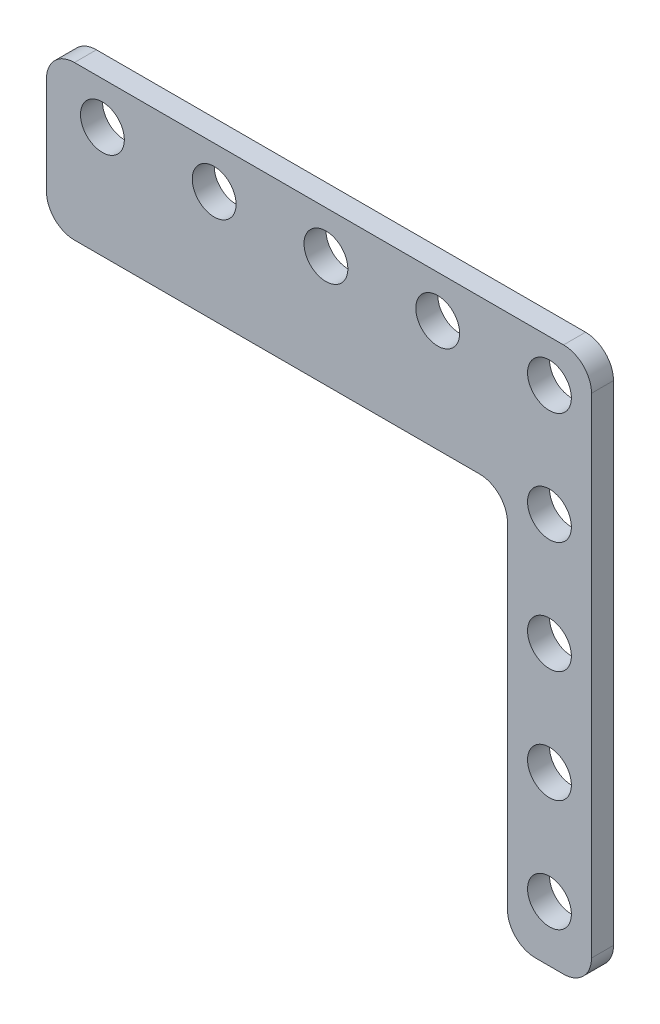
ISO-10303-21;
HEADER;
FILE_DESCRIPTION(('STEP AP214'),'2;1');
FILE_NAME('part.step','',(''),(''),'','','');
FILE_SCHEMA(('AUTOMOTIVE_DESIGN { 1 0 10303 214 1 1 1 1 }'));
ENDSEC;
DATA;
#1=APPLICATION_CONTEXT('core data for automotive mechanical design processes');
#2=APPLICATION_PROTOCOL_DEFINITION('international standard','automotive_design',2000,#1);
#3=PRODUCT_CONTEXT('',#1,'mechanical');
#4=PRODUCT('Part','Part','',(#3));
#5=PRODUCT_RELATED_PRODUCT_CATEGORY('part','',(#4));
#6=PRODUCT_DEFINITION_FORMATION('','',#4);
#7=PRODUCT_DEFINITION_CONTEXT('part definition',#1,'design');
#8=PRODUCT_DEFINITION('design','',#6,#7);
#9=PRODUCT_DEFINITION_SHAPE('','',#8);
#10=(LENGTH_UNIT() NAMED_UNIT(*) SI_UNIT(.MILLI.,.METRE.));
#11=(NAMED_UNIT(*) PLANE_ANGLE_UNIT() SI_UNIT($,.RADIAN.));
#12=(NAMED_UNIT(*) SI_UNIT($,.STERADIAN.) SOLID_ANGLE_UNIT());
#13=UNCERTAINTY_MEASURE_WITH_UNIT(LENGTH_MEASURE(1.E-05),#10,'distance_accuracy_value','');
#14=(GEOMETRIC_REPRESENTATION_CONTEXT(3) GLOBAL_UNCERTAINTY_ASSIGNED_CONTEXT((#13)) GLOBAL_UNIT_ASSIGNED_CONTEXT((#10,
#11,#12)) REPRESENTATION_CONTEXT('',''));
#15=CARTESIAN_POINT('',(0.,0.,0.));
#16=DIRECTION('',(0.,0.,1.));
#17=DIRECTION('',(1.,0.,0.));
#18=AXIS2_PLACEMENT_3D('',#15,#16,#17);
#19=CARTESIAN_POINT('',(-1.6002000000002,-53.9749999999999,-2.5));
#20=DIRECTION('',(0.,0.,1.));
#21=DIRECTION('',(1.,0.,0.));
#22=AXIS2_PLACEMENT_3D('',#19,#20,#21);
#23=CYLINDRICAL_SURFACE('',#22,3.17499999999994);
#24=CARTESIAN_POINT('',(-1.6002000000002,-53.9749999999999,0.));
#25=DIRECTION('',(0.,0.,1.));
#26=DIRECTION('',(1.,0.,0.));
#27=AXIS2_PLACEMENT_3D('',#24,#25,#26);
#28=CIRCLE('',#27,3.17499999999994);
#29=CARTESIAN_POINT('',(-4.77520000000016,-53.9749999999999,0.));
#30=VERTEX_POINT('',#29);
#31=CARTESIAN_POINT('',(-1.6002000000002,-57.1499999999998,0.));
#32=VERTEX_POINT('',#31);
#33=EDGE_CURVE('E164',#30,#32,#28,.T.);
#34=ORIENTED_EDGE('',*,*,#33,.F.);
#35=DIRECTION('',(0.,0.,1.));
#36=VECTOR('',#35,1.);
#37=CARTESIAN_POINT('',(-4.77520000000016,-53.9749999999999,-2.5));
#38=LINE('',#37,#36);
#39=CARTESIAN_POINT('',(-4.77520000000016,-53.9749999999999,-2.5));
#40=VERTEX_POINT('',#39);
#41=EDGE_CURVE('E11',#40,#30,#38,.T.);
#42=ORIENTED_EDGE('',*,*,#41,.F.);
#43=CARTESIAN_POINT('',(-1.6002000000002,-53.9749999999999,-2.5));
#44=DIRECTION('',(0.,0.,1.));
#45=DIRECTION('',(1.,0.,0.));
#46=AXIS2_PLACEMENT_3D('',#43,#44,#45);
#47=CIRCLE('',#46,3.17499999999994);
#48=CARTESIAN_POINT('',(-1.6002000000002,-57.1499999999998,-2.5));
#49=VERTEX_POINT('',#48);
#50=EDGE_CURVE('E197',#40,#49,#47,.T.);
#51=ORIENTED_EDGE('',*,*,#50,.T.);
#52=DIRECTION('',(0.,0.,1.));
#53=VECTOR('',#52,1.);
#54=CARTESIAN_POINT('',(-1.6002000000002,-57.1499999999998,-2.5));
#55=LINE('',#54,#53);
#56=EDGE_CURVE('E46',#49,#32,#55,.T.);
#57=ORIENTED_EDGE('',*,*,#56,.T.);
#58=EDGE_LOOP('',(#34,#42,#51,#57));
#59=FACE_BOUND('',#58,.T.);
#60=ADVANCED_FACE('F43',(#59),#23,.T.);
#61=CARTESIAN_POINT('',(-4.77520000000016,-15.875,-2.5));
#62=DIRECTION('',(-1.,0.,0.));
#63=DIRECTION('',(0.,-1.,0.));
#64=AXIS2_PLACEMENT_3D('',#61,#62,#63);
#65=PLANE('',#64);
#66=DIRECTION('',(0.,-1.,0.));
#67=VECTOR('',#66,1.);
#68=CARTESIAN_POINT('',(-4.77520000000016,-15.875,0.));
#69=LINE('',#68,#67);
#70=CARTESIAN_POINT('',(-4.77520000000016,-15.875,0.));
#71=VERTEX_POINT('',#70);
#72=EDGE_CURVE('E195',#71,#30,#69,.T.);
#73=ORIENTED_EDGE('',*,*,#72,.F.);
#74=DIRECTION('',(0.,0.,1.));
#75=VECTOR('',#74,1.);
#76=CARTESIAN_POINT('',(-4.77520000000016,-15.875,-2.5));
#77=LINE('',#76,#75);
#78=CARTESIAN_POINT('',(-4.77520000000016,-15.875,-2.5));
#79=VERTEX_POINT('',#78);
#80=EDGE_CURVE('E52',#79,#71,#77,.T.);
#81=ORIENTED_EDGE('',*,*,#80,.F.);
#82=DIRECTION('',(0.,-1.,0.));
#83=VECTOR('',#82,1.);
#84=CARTESIAN_POINT('',(-4.77520000000016,-15.875,-2.5));
#85=LINE('',#84,#83);
#86=EDGE_CURVE('E154',#79,#40,#85,.T.);
#87=ORIENTED_EDGE('',*,*,#86,.T.);
#88=ORIENTED_EDGE('',*,*,#41,.T.);
#89=EDGE_LOOP('',(#73,#81,#87,#88));
#90=FACE_BOUND('',#89,.T.);
#91=ADVANCED_FACE('F217',(#90),#65,.T.);
#92=CARTESIAN_POINT('',(-7.95020000000018,-15.875,-2.5));
#93=DIRECTION('',(0.,0.,1.));
#94=DIRECTION('',(1.,0.,0.));
#95=AXIS2_PLACEMENT_3D('',#92,#93,#94);
#96=CYLINDRICAL_SURFACE('',#95,3.17500000000003);
#97=CARTESIAN_POINT('',(-7.95020000000018,-15.875,0.));
#98=DIRECTION('',(0.,0.,-1.));
#99=DIRECTION('',(-1.,0.,0.));
#100=AXIS2_PLACEMENT_3D('',#97,#98,#99);
#101=CIRCLE('',#100,3.17500000000003);
#102=CARTESIAN_POINT('',(-7.95020000000018,-12.6999999999999,0.));
#103=VERTEX_POINT('',#102);
#104=EDGE_CURVE('E141',#103,#71,#101,.T.);
#105=ORIENTED_EDGE('',*,*,#104,.F.);
#106=DIRECTION('',(0.,0.,1.));
#107=VECTOR('',#106,1.);
#108=CARTESIAN_POINT('',(-7.95020000000018,-12.6999999999999,-2.5));
#109=LINE('',#108,#107);
#110=CARTESIAN_POINT('',(-7.95020000000018,-12.6999999999999,-2.5));
#111=VERTEX_POINT('',#110);
#112=EDGE_CURVE('E136',#111,#103,#109,.T.);
#113=ORIENTED_EDGE('',*,*,#112,.F.);
#114=CARTESIAN_POINT('',(-7.95020000000018,-15.875,-2.5));
#115=DIRECTION('',(0.,0.,-1.));
#116=DIRECTION('',(-1.,0.,0.));
#117=AXIS2_PLACEMENT_3D('',#114,#115,#116);
#118=CIRCLE('',#117,3.17500000000003);
#119=EDGE_CURVE('E139',#111,#79,#118,.T.);
#120=ORIENTED_EDGE('',*,*,#119,.T.);
#121=ORIENTED_EDGE('',*,*,#80,.T.);
#122=EDGE_LOOP('',(#105,#113,#120,#121));
#123=FACE_BOUND('',#122,.T.);
#124=ADVANCED_FACE('F138',(#123),#96,.F.);
#125=CARTESIAN_POINT('',(-53.9749999999999,-12.6999999999999,-2.5));
#126=DIRECTION('',(0.,-1.,0.));
#127=DIRECTION('',(0.,0.,-1.));
#128=AXIS2_PLACEMENT_3D('',#125,#126,#127);
#129=PLANE('',#128);
#130=DIRECTION('',(1.,0.,0.));
#131=VECTOR('',#130,1.);
#132=CARTESIAN_POINT('',(-53.9749999999999,-12.6999999999999,0.));
#133=LINE('',#132,#131);
#134=CARTESIAN_POINT('',(-53.9749999999999,-12.6999999999999,0.));
#135=VERTEX_POINT('',#134);
#136=EDGE_CURVE('E192',#135,#103,#133,.T.);
#137=ORIENTED_EDGE('',*,*,#136,.F.);
#138=DIRECTION('',(0.,0.,1.));
#139=VECTOR('',#138,1.);
#140=CARTESIAN_POINT('',(-53.9749999999999,-12.6999999999999,-2.5));
#141=LINE('',#140,#139);
#142=CARTESIAN_POINT('',(-53.9749999999999,-12.6999999999999,-2.5));
#143=VERTEX_POINT('',#142);
#144=EDGE_CURVE('E146',#143,#135,#141,.T.);
#145=ORIENTED_EDGE('',*,*,#144,.F.);
#146=DIRECTION('',(1.,0.,0.));
#147=VECTOR('',#146,1.);
#148=CARTESIAN_POINT('',(-53.9749999999999,-12.6999999999999,-2.5));
#149=LINE('',#148,#147);
#150=EDGE_CURVE('E152',#143,#111,#149,.T.);
#151=ORIENTED_EDGE('',*,*,#150,.T.);
#152=ORIENTED_EDGE('',*,*,#112,.T.);
#153=EDGE_LOOP('',(#137,#145,#151,#152));
#154=FACE_BOUND('',#153,.T.);
#155=ADVANCED_FACE('F156',(#154),#129,.T.);
#156=CARTESIAN_POINT('',(-53.9749999999999,-9.52500000000001,-2.5));
#157=DIRECTION('',(0.,0.,1.));
#158=DIRECTION('',(1.,0.,0.));
#159=AXIS2_PLACEMENT_3D('',#156,#157,#158);
#160=CYLINDRICAL_SURFACE('',#159,3.17499999999993);
#161=CARTESIAN_POINT('',(-53.9749999999999,-9.52500000000001,0.));
#162=DIRECTION('',(0.,0.,1.));
#163=DIRECTION('',(1.,0.,0.));
#164=AXIS2_PLACEMENT_3D('',#161,#162,#163);
#165=CIRCLE('',#164,3.17499999999993);
#166=CARTESIAN_POINT('',(-57.1499999999998,-9.52500000000001,0.));
#167=VERTEX_POINT('',#166);
#168=EDGE_CURVE('E189',#167,#135,#165,.T.);
#169=ORIENTED_EDGE('',*,*,#168,.F.);
#170=DIRECTION('',(0.,0.,1.));
#171=VECTOR('',#170,1.);
#172=CARTESIAN_POINT('',(-57.1499999999998,-9.52500000000001,-2.5));
#173=LINE('',#172,#171);
#174=CARTESIAN_POINT('',(-57.1499999999998,-9.52500000000001,-2.5));
#175=VERTEX_POINT('',#174);
#176=EDGE_CURVE('E201',#175,#167,#173,.T.);
#177=ORIENTED_EDGE('',*,*,#176,.F.);
#178=CARTESIAN_POINT('',(-53.9749999999999,-9.52500000000001,-2.5));
#179=DIRECTION('',(0.,0.,1.));
#180=DIRECTION('',(1.,0.,0.));
#181=AXIS2_PLACEMENT_3D('',#178,#179,#180);
#182=CIRCLE('',#181,3.17499999999993);
#183=EDGE_CURVE('E157',#175,#143,#182,.T.);
#184=ORIENTED_EDGE('',*,*,#183,.T.);
#185=ORIENTED_EDGE('',*,*,#144,.T.);
#186=EDGE_LOOP('',(#169,#177,#184,#185));
#187=FACE_BOUND('',#186,.T.);
#188=ADVANCED_FACE('F230',(#187),#160,.T.);
#189=CARTESIAN_POINT('',(-57.1499999999998,1.60020000000016,-2.5));
#190=DIRECTION('',(-1.,0.,0.));
#191=DIRECTION('',(0.,0.,1.));
#192=AXIS2_PLACEMENT_3D('',#189,#190,#191);
#193=PLANE('',#192);
#194=DIRECTION('',(0.,-1.,0.));
#195=VECTOR('',#194,1.);
#196=CARTESIAN_POINT('',(-57.1499999999998,1.60020000000016,0.));
#197=LINE('',#196,#195);
#198=CARTESIAN_POINT('',(-57.1499999999998,1.60020000000016,0.));
#199=VERTEX_POINT('',#198);
#200=EDGE_CURVE('E186',#199,#167,#197,.T.);
#201=ORIENTED_EDGE('',*,*,#200,.F.);
#202=DIRECTION('',(0.,0.,1.));
#203=VECTOR('',#202,1.);
#204=CARTESIAN_POINT('',(-57.1499999999998,1.60020000000016,-2.5));
#205=LINE('',#204,#203);
#206=CARTESIAN_POINT('',(-57.1499999999998,1.60020000000016,-2.5));
#207=VERTEX_POINT('',#206);
#208=EDGE_CURVE('E203',#207,#199,#205,.T.);
#209=ORIENTED_EDGE('',*,*,#208,.F.);
#210=DIRECTION('',(0.,-1.,0.));
#211=VECTOR('',#210,1.);
#212=CARTESIAN_POINT('',(-57.1499999999998,1.60020000000016,-2.5));
#213=LINE('',#212,#211);
#214=EDGE_CURVE('E159',#207,#175,#213,.T.);
#215=ORIENTED_EDGE('',*,*,#214,.T.);
#216=ORIENTED_EDGE('',*,*,#176,.T.);
#217=EDGE_LOOP('',(#201,#209,#215,#216));
#218=FACE_BOUND('',#217,.T.);
#219=ADVANCED_FACE('F233',(#218),#193,.T.);
#220=CARTESIAN_POINT('',(-53.9749999999999,1.60020000000016,-2.5));
#221=DIRECTION('',(0.,0.,1.));
#222=DIRECTION('',(1.,0.,0.));
#223=AXIS2_PLACEMENT_3D('',#220,#221,#222);
#224=CYLINDRICAL_SURFACE('',#223,3.17499999999993);
#225=CARTESIAN_POINT('',(-53.9749999999999,1.60020000000016,0.));
#226=DIRECTION('',(0.,0.,1.));
#227=DIRECTION('',(1.,0.,0.));
#228=AXIS2_PLACEMENT_3D('',#225,#226,#227);
#229=CIRCLE('',#228,3.17499999999993);
#230=CARTESIAN_POINT('',(-53.9749999999999,4.77520000000009,0.));
#231=VERTEX_POINT('',#230);
#232=EDGE_CURVE('E183',#231,#199,#229,.T.);
#233=ORIENTED_EDGE('',*,*,#232,.F.);
#234=DIRECTION('',(0.,0.,1.));
#235=VECTOR('',#234,1.);
#236=CARTESIAN_POINT('',(-53.9749999999999,4.77520000000009,-2.5));
#237=LINE('',#236,#235);
#238=CARTESIAN_POINT('',(-53.9749999999999,4.77520000000009,-2.5));
#239=VERTEX_POINT('',#238);
#240=EDGE_CURVE('E205',#239,#231,#237,.T.);
#241=ORIENTED_EDGE('',*,*,#240,.F.);
#242=CARTESIAN_POINT('',(-53.9749999999999,1.60020000000016,-2.5));
#243=DIRECTION('',(0.,0.,1.));
#244=DIRECTION('',(1.,0.,0.));
#245=AXIS2_PLACEMENT_3D('',#242,#243,#244);
#246=CIRCLE('',#245,3.17499999999993);
#247=EDGE_CURVE('E377',#239,#207,#246,.T.);
#248=ORIENTED_EDGE('',*,*,#247,.T.);
#249=ORIENTED_EDGE('',*,*,#208,.T.);
#250=EDGE_LOOP('',(#233,#241,#248,#249));
#251=FACE_BOUND('',#250,.T.);
#252=ADVANCED_FACE('F237',(#251),#224,.T.);
#253=CARTESIAN_POINT('',(1.60020000000007,4.77520000000009,-2.5));
#254=DIRECTION('',(0.,1.,0.));
#255=DIRECTION('',(0.,0.,1.));
#256=AXIS2_PLACEMENT_3D('',#253,#254,#255);
#257=PLANE('',#256);
#258=DIRECTION('',(-1.,0.,0.));
#259=VECTOR('',#258,1.);
#260=CARTESIAN_POINT('',(1.60020000000007,4.77520000000009,0.));
#261=LINE('',#260,#259);
#262=CARTESIAN_POINT('',(1.60020000000007,4.77520000000009,0.));
#263=VERTEX_POINT('',#262);
#264=EDGE_CURVE('E180',#263,#231,#261,.T.);
#265=ORIENTED_EDGE('',*,*,#264,.F.);
#266=DIRECTION('',(0.,0.,1.));
#267=VECTOR('',#266,1.);
#268=CARTESIAN_POINT('',(1.60020000000007,4.77520000000009,-2.5));
#269=LINE('',#268,#267);
#270=CARTESIAN_POINT('',(1.60020000000007,4.77520000000009,-2.5));
#271=VERTEX_POINT('',#270);
#272=EDGE_CURVE('E207',#271,#263,#269,.T.);
#273=ORIENTED_EDGE('',*,*,#272,.F.);
#274=DIRECTION('',(-1.,0.,0.));
#275=VECTOR('',#274,1.);
#276=CARTESIAN_POINT('',(1.60020000000007,4.77520000000009,-2.5));
#277=LINE('',#276,#275);
#278=EDGE_CURVE('E374',#271,#239,#277,.T.);
#279=ORIENTED_EDGE('',*,*,#278,.T.);
#280=ORIENTED_EDGE('',*,*,#240,.T.);
#281=EDGE_LOOP('',(#265,#273,#279,#280));
#282=FACE_BOUND('',#281,.T.);
#283=ADVANCED_FACE('F241',(#282),#257,.T.);
#284=CARTESIAN_POINT('',(1.60020000000007,1.60020000000016,-2.5));
#285=DIRECTION('',(0.,0.,1.));
#286=DIRECTION('',(1.,0.,0.));
#287=AXIS2_PLACEMENT_3D('',#284,#285,#286);
#288=CYLINDRICAL_SURFACE('',#287,3.17499999999995);
#289=CARTESIAN_POINT('',(1.60020000000007,1.60020000000016,0.));
#290=DIRECTION('',(0.,0.,1.));
#291=DIRECTION('',(1.,0.,0.));
#292=AXIS2_PLACEMENT_3D('',#289,#290,#291);
#293=CIRCLE('',#292,3.17499999999995);
#294=CARTESIAN_POINT('',(4.77520000000002,1.60020000000016,0.));
#295=VERTEX_POINT('',#294);
#296=EDGE_CURVE('E177',#295,#263,#293,.T.);
#297=ORIENTED_EDGE('',*,*,#296,.F.);
#298=DIRECTION('',(0.,0.,1.));
#299=VECTOR('',#298,1.);
#300=CARTESIAN_POINT('',(4.77520000000002,1.60020000000016,-2.5));
#301=LINE('',#300,#299);
#302=CARTESIAN_POINT('',(4.77520000000002,1.60020000000016,-2.5));
#303=VERTEX_POINT('',#302);
#304=EDGE_CURVE('E209',#303,#295,#301,.T.);
#305=ORIENTED_EDGE('',*,*,#304,.F.);
#306=CARTESIAN_POINT('',(1.60020000000007,1.60020000000016,-2.5));
#307=DIRECTION('',(0.,0.,1.));
#308=DIRECTION('',(1.,0.,0.));
#309=AXIS2_PLACEMENT_3D('',#306,#307,#308);
#310=CIRCLE('',#309,3.17499999999995);
#311=EDGE_CURVE('E371',#303,#271,#310,.T.);
#312=ORIENTED_EDGE('',*,*,#311,.T.);
#313=ORIENTED_EDGE('',*,*,#272,.T.);
#314=EDGE_LOOP('',(#297,#305,#312,#313));
#315=FACE_BOUND('',#314,.T.);
#316=ADVANCED_FACE('F245',(#315),#288,.T.);
#317=CARTESIAN_POINT('',(4.77520000000004,-53.9749999999999,-2.5));
#318=DIRECTION('',(1.,0.,0.));
#319=DIRECTION('',(0.,0.,-1.));
#320=AXIS2_PLACEMENT_3D('',#317,#318,#319);
#321=PLANE('',#320);
#322=DIRECTION('',(0.,1.,0.));
#323=VECTOR('',#322,1.);
#324=CARTESIAN_POINT('',(4.77520000000004,-53.9749999999999,0.));
#325=LINE('',#324,#323);
#326=CARTESIAN_POINT('',(4.77520000000004,-53.9749999999999,0.));
#327=VERTEX_POINT('',#326);
#328=EDGE_CURVE('E174',#327,#295,#325,.T.);
#329=ORIENTED_EDGE('',*,*,#328,.F.);
#330=DIRECTION('',(0.,0.,1.));
#331=VECTOR('',#330,1.);
#332=CARTESIAN_POINT('',(4.77520000000004,-53.9749999999999,-2.5));
#333=LINE('',#332,#331);
#334=CARTESIAN_POINT('',(4.77520000000004,-53.9749999999999,-2.5));
#335=VERTEX_POINT('',#334);
#336=EDGE_CURVE('E211',#335,#327,#333,.T.);
#337=ORIENTED_EDGE('',*,*,#336,.F.);
#338=DIRECTION('',(0.,1.,0.));
#339=VECTOR('',#338,1.);
#340=CARTESIAN_POINT('',(4.77520000000004,-53.9749999999999,-2.5));
#341=LINE('',#340,#339);
#342=EDGE_CURVE('E368',#335,#303,#341,.T.);
#343=ORIENTED_EDGE('',*,*,#342,.T.);
#344=ORIENTED_EDGE('',*,*,#304,.T.);
#345=EDGE_LOOP('',(#329,#337,#343,#344));
#346=FACE_BOUND('',#345,.T.);
#347=ADVANCED_FACE('F249',(#346),#321,.T.);
#348=CARTESIAN_POINT('',(1.60020000000007,-53.9749999999999,-2.5));
#349=DIRECTION('',(0.,0.,1.));
#350=DIRECTION('',(1.,0.,0.));
#351=AXIS2_PLACEMENT_3D('',#348,#349,#350);
#352=CYLINDRICAL_SURFACE('',#351,3.17499999999995);
#353=CARTESIAN_POINT('',(1.60020000000007,-53.9749999999999,0.));
#354=DIRECTION('',(0.,0.,1.));
#355=DIRECTION('',(1.,0.,0.));
#356=AXIS2_PLACEMENT_3D('',#353,#354,#355);
#357=CIRCLE('',#356,3.17499999999995);
#358=CARTESIAN_POINT('',(1.60020000000007,-57.1499999999998,0.));
#359=VERTEX_POINT('',#358);
#360=EDGE_CURVE('E171',#359,#327,#357,.T.);
#361=ORIENTED_EDGE('',*,*,#360,.F.);
#362=DIRECTION('',(0.,0.,1.));
#363=VECTOR('',#362,1.);
#364=CARTESIAN_POINT('',(1.60020000000007,-57.1499999999998,-2.5));
#365=LINE('',#364,#363);
#366=CARTESIAN_POINT('',(1.60020000000007,-57.1499999999998,-2.5));
#367=VERTEX_POINT('',#366);
#368=EDGE_CURVE('E212',#367,#359,#365,.T.);
#369=ORIENTED_EDGE('',*,*,#368,.F.);
#370=CARTESIAN_POINT('',(1.60020000000007,-53.9749999999999,-2.5));
#371=DIRECTION('',(0.,0.,1.));
#372=DIRECTION('',(1.,0.,0.));
#373=AXIS2_PLACEMENT_3D('',#370,#371,#372);
#374=CIRCLE('',#373,3.17499999999995);
#375=EDGE_CURVE('E365',#367,#335,#374,.T.);
#376=ORIENTED_EDGE('',*,*,#375,.T.);
#377=ORIENTED_EDGE('',*,*,#336,.T.);
#378=EDGE_LOOP('',(#361,#369,#376,#377));
#379=FACE_BOUND('',#378,.T.);
#380=ADVANCED_FACE('F253',(#379),#352,.T.);
#381=CARTESIAN_POINT('',(-1.6002000000002,-57.1499999999998,-2.5));
#382=DIRECTION('',(0.,-1.,0.));
#383=DIRECTION('',(0.,0.,-1.));
#384=AXIS2_PLACEMENT_3D('',#381,#382,#383);
#385=PLANE('',#384);
#386=DIRECTION('',(1.,0.,0.));
#387=VECTOR('',#386,1.);
#388=CARTESIAN_POINT('',(-1.6002000000002,-57.1499999999998,0.));
#389=LINE('',#388,#387);
#390=EDGE_CURVE('E167',#32,#359,#389,.T.);
#391=ORIENTED_EDGE('',*,*,#390,.F.);
#392=ORIENTED_EDGE('',*,*,#56,.F.);
#393=DIRECTION('',(1.,0.,0.));
#394=VECTOR('',#393,1.);
#395=CARTESIAN_POINT('',(-1.6002000000002,-57.1499999999998,-2.5));
#396=LINE('',#395,#394);
#397=EDGE_CURVE('E363',#49,#367,#396,.T.);
#398=ORIENTED_EDGE('',*,*,#397,.T.);
#399=ORIENTED_EDGE('',*,*,#368,.T.);
#400=EDGE_LOOP('',(#391,#392,#398,#399));
#401=FACE_BOUND('',#400,.T.);
#402=ADVANCED_FACE('F214',(#401),#385,.T.);
#403=CARTESIAN_POINT('',(-1.6002000000002,-53.9749999999999,-2.5));
#404=DIRECTION('',(0.,0.,1.));
#405=DIRECTION('',(1.,0.,0.));
#406=AXIS2_PLACEMENT_3D('',#403,#404,#405);
#407=PLANE('',#406);
#408=CARTESIAN_POINT('',(0.,-50.8,-2.5));
#409=DIRECTION('',(0.,0.,1.));
#410=DIRECTION('',(-1.,0.,0.));
#411=AXIS2_PLACEMENT_3D('',#408,#409,#410);
#412=CIRCLE('',#411,2.4892);
#413=CARTESIAN_POINT('',(-2.4892,-50.8,-2.5));
#414=VERTEX_POINT('',#413);
#415=EDGE_CURVE('E308',#414,#414,#412,.T.);
#416=ORIENTED_EDGE('',*,*,#415,.T.);
#417=EDGE_LOOP('',(#416));
#418=FACE_BOUND('',#417,.T.);
#419=CARTESIAN_POINT('',(0.,-38.1,-2.5));
#420=DIRECTION('',(0.,0.,1.));
#421=DIRECTION('',(-1.,0.,0.));
#422=AXIS2_PLACEMENT_3D('',#419,#420,#421);
#423=CIRCLE('',#422,2.4892);
#424=CARTESIAN_POINT('',(-2.4892,-38.1,-2.5));
#425=VERTEX_POINT('',#424);
#426=EDGE_CURVE('E316',#425,#425,#423,.T.);
#427=ORIENTED_EDGE('',*,*,#426,.T.);
#428=EDGE_LOOP('',(#427));
#429=FACE_BOUND('',#428,.T.);
#430=CARTESIAN_POINT('',(0.,-25.4,-2.5));
#431=DIRECTION('',(0.,0.,1.));
#432=DIRECTION('',(-1.,0.,0.));
#433=AXIS2_PLACEMENT_3D('',#430,#431,#432);
#434=CIRCLE('',#433,2.4892);
#435=CARTESIAN_POINT('',(-2.4892,-25.4,-2.5));
#436=VERTEX_POINT('',#435);
#437=EDGE_CURVE('E322',#436,#436,#434,.T.);
#438=ORIENTED_EDGE('',*,*,#437,.T.);
#439=EDGE_LOOP('',(#438));
#440=FACE_BOUND('',#439,.T.);
#441=CARTESIAN_POINT('',(0.,-12.7,-2.5));
#442=DIRECTION('',(0.,0.,1.));
#443=DIRECTION('',(-1.,0.,0.));
#444=AXIS2_PLACEMENT_3D('',#441,#442,#443);
#445=CIRCLE('',#444,2.4892);
#446=CARTESIAN_POINT('',(-2.4892,-12.7,-2.5));
#447=VERTEX_POINT('',#446);
#448=EDGE_CURVE('E328',#447,#447,#445,.T.);
#449=ORIENTED_EDGE('',*,*,#448,.T.);
#450=EDGE_LOOP('',(#449));
#451=FACE_BOUND('',#450,.T.);
#452=CARTESIAN_POINT('',(-50.8,0.,-2.5));
#453=DIRECTION('',(0.,0.,1.));
#454=DIRECTION('',(-1.,0.,0.));
#455=AXIS2_PLACEMENT_3D('',#452,#453,#454);
#456=CIRCLE('',#455,2.4892);
#457=CARTESIAN_POINT('',(-53.2892,0.,-2.5));
#458=VERTEX_POINT('',#457);
#459=EDGE_CURVE('E334',#458,#458,#456,.T.);
#460=ORIENTED_EDGE('',*,*,#459,.T.);
#461=EDGE_LOOP('',(#460));
#462=FACE_BOUND('',#461,.T.);
#463=CARTESIAN_POINT('',(-38.1,0.,-2.5));
#464=DIRECTION('',(0.,0.,1.));
#465=DIRECTION('',(-1.,0.,0.));
#466=AXIS2_PLACEMENT_3D('',#463,#464,#465);
#467=CIRCLE('',#466,2.4892);
#468=CARTESIAN_POINT('',(-40.5892,0.,-2.5));
#469=VERTEX_POINT('',#468);
#470=EDGE_CURVE('E340',#469,#469,#467,.T.);
#471=ORIENTED_EDGE('',*,*,#470,.T.);
#472=EDGE_LOOP('',(#471));
#473=FACE_BOUND('',#472,.T.);
#474=CARTESIAN_POINT('',(-25.4,0.,-2.5));
#475=DIRECTION('',(0.,0.,1.));
#476=DIRECTION('',(-1.,0.,0.));
#477=AXIS2_PLACEMENT_3D('',#474,#475,#476);
#478=CIRCLE('',#477,2.4892);
#479=CARTESIAN_POINT('',(-27.8892,0.,-2.5));
#480=VERTEX_POINT('',#479);
#481=EDGE_CURVE('E346',#480,#480,#478,.T.);
#482=ORIENTED_EDGE('',*,*,#481,.T.);
#483=EDGE_LOOP('',(#482));
#484=FACE_BOUND('',#483,.T.);
#485=CARTESIAN_POINT('',(-12.7,0.,-2.5));
#486=DIRECTION('',(0.,0.,1.));
#487=DIRECTION('',(-1.,0.,0.));
#488=AXIS2_PLACEMENT_3D('',#485,#486,#487);
#489=CIRCLE('',#488,2.4892);
#490=CARTESIAN_POINT('',(-15.1892,0.,-2.5));
#491=VERTEX_POINT('',#490);
#492=EDGE_CURVE('E352',#491,#491,#489,.T.);
#493=ORIENTED_EDGE('',*,*,#492,.T.);
#494=EDGE_LOOP('',(#493));
#495=FACE_BOUND('',#494,.T.);
#496=CARTESIAN_POINT('',(0.,0.,-2.5));
#497=DIRECTION('',(0.,0.,1.));
#498=DIRECTION('',(-1.,0.,0.));
#499=AXIS2_PLACEMENT_3D('',#496,#497,#498);
#500=CIRCLE('',#499,2.4892);
#501=CARTESIAN_POINT('',(-2.4892,0.,-2.5));
#502=VERTEX_POINT('',#501);
#503=EDGE_CURVE('E168',#502,#502,#500,.T.);
#504=ORIENTED_EDGE('',*,*,#503,.T.);
#505=EDGE_LOOP('',(#504));
#506=FACE_BOUND('',#505,.T.);
#507=ORIENTED_EDGE('',*,*,#50,.F.);
#508=ORIENTED_EDGE('',*,*,#86,.F.);
#509=ORIENTED_EDGE('',*,*,#119,.F.);
#510=ORIENTED_EDGE('',*,*,#150,.F.);
#511=ORIENTED_EDGE('',*,*,#183,.F.);
#512=ORIENTED_EDGE('',*,*,#214,.F.);
#513=ORIENTED_EDGE('',*,*,#247,.F.);
#514=ORIENTED_EDGE('',*,*,#278,.F.);
#515=ORIENTED_EDGE('',*,*,#311,.F.);
#516=ORIENTED_EDGE('',*,*,#342,.F.);
#517=ORIENTED_EDGE('',*,*,#375,.F.);
#518=ORIENTED_EDGE('',*,*,#397,.F.);
#519=EDGE_LOOP('',(#507,#508,#509,#510,#511,#512,#513,#514,#515,#516,#517,#518));
#520=FACE_BOUND('',#519,.T.);
#521=ADVANCED_FACE('F150',(#418,#429,#440,#451,#462,#473,#484,#495,#506,#520),#407,.F.);
#522=CARTESIAN_POINT('',(-1.6002000000002,-53.9749999999999,0.));
#523=DIRECTION('',(0.,0.,1.));
#524=DIRECTION('',(1.,0.,0.));
#525=AXIS2_PLACEMENT_3D('',#522,#523,#524);
#526=PLANE('',#525);
#527=CARTESIAN_POINT('',(0.,-50.8,0.));
#528=DIRECTION('',(0.,0.,1.));
#529=DIRECTION('',(-1.,0.,0.));
#530=AXIS2_PLACEMENT_3D('',#527,#528,#529);
#531=CIRCLE('',#530,2.4892);
#532=CARTESIAN_POINT('',(-2.4892,-50.8,0.));
#533=VERTEX_POINT('',#532);
#534=EDGE_CURVE('E311',#533,#533,#531,.T.);
#535=ORIENTED_EDGE('',*,*,#534,.F.);
#536=EDGE_LOOP('',(#535));
#537=FACE_BOUND('',#536,.T.);
#538=CARTESIAN_POINT('',(0.,-38.1,0.));
#539=DIRECTION('',(0.,0.,1.));
#540=DIRECTION('',(-1.,0.,0.));
#541=AXIS2_PLACEMENT_3D('',#538,#539,#540);
#542=CIRCLE('',#541,2.4892);
#543=CARTESIAN_POINT('',(-2.4892,-38.1,0.));
#544=VERTEX_POINT('',#543);
#545=EDGE_CURVE('E313',#544,#544,#542,.T.);
#546=ORIENTED_EDGE('',*,*,#545,.F.);
#547=EDGE_LOOP('',(#546));
#548=FACE_BOUND('',#547,.T.);
#549=CARTESIAN_POINT('',(0.,-25.4,0.));
#550=DIRECTION('',(0.,0.,1.));
#551=DIRECTION('',(-1.,0.,0.));
#552=AXIS2_PLACEMENT_3D('',#549,#550,#551);
#553=CIRCLE('',#552,2.4892);
#554=CARTESIAN_POINT('',(-2.4892,-25.4,0.));
#555=VERTEX_POINT('',#554);
#556=EDGE_CURVE('E319',#555,#555,#553,.T.);
#557=ORIENTED_EDGE('',*,*,#556,.F.);
#558=EDGE_LOOP('',(#557));
#559=FACE_BOUND('',#558,.T.);
#560=CARTESIAN_POINT('',(0.,-12.7,0.));
#561=DIRECTION('',(0.,0.,1.));
#562=DIRECTION('',(-1.,0.,0.));
#563=AXIS2_PLACEMENT_3D('',#560,#561,#562);
#564=CIRCLE('',#563,2.4892);
#565=CARTESIAN_POINT('',(-2.4892,-12.7,0.));
#566=VERTEX_POINT('',#565);
#567=EDGE_CURVE('E325',#566,#566,#564,.T.);
#568=ORIENTED_EDGE('',*,*,#567,.F.);
#569=EDGE_LOOP('',(#568));
#570=FACE_BOUND('',#569,.T.);
#571=CARTESIAN_POINT('',(-50.8,0.,0.));
#572=DIRECTION('',(0.,0.,1.));
#573=DIRECTION('',(-1.,0.,0.));
#574=AXIS2_PLACEMENT_3D('',#571,#572,#573);
#575=CIRCLE('',#574,2.4892);
#576=CARTESIAN_POINT('',(-53.2892,0.,0.));
#577=VERTEX_POINT('',#576);
#578=EDGE_CURVE('E331',#577,#577,#575,.T.);
#579=ORIENTED_EDGE('',*,*,#578,.F.);
#580=EDGE_LOOP('',(#579));
#581=FACE_BOUND('',#580,.T.);
#582=CARTESIAN_POINT('',(-38.1,0.,0.));
#583=DIRECTION('',(0.,0.,1.));
#584=DIRECTION('',(-1.,0.,0.));
#585=AXIS2_PLACEMENT_3D('',#582,#583,#584);
#586=CIRCLE('',#585,2.4892);
#587=CARTESIAN_POINT('',(-40.5892,0.,0.));
#588=VERTEX_POINT('',#587);
#589=EDGE_CURVE('E337',#588,#588,#586,.T.);
#590=ORIENTED_EDGE('',*,*,#589,.F.);
#591=EDGE_LOOP('',(#590));
#592=FACE_BOUND('',#591,.T.);
#593=CARTESIAN_POINT('',(-25.4,0.,0.));
#594=DIRECTION('',(0.,0.,1.));
#595=DIRECTION('',(-1.,0.,0.));
#596=AXIS2_PLACEMENT_3D('',#593,#594,#595);
#597=CIRCLE('',#596,2.4892);
#598=CARTESIAN_POINT('',(-27.8892,0.,0.));
#599=VERTEX_POINT('',#598);
#600=EDGE_CURVE('E343',#599,#599,#597,.T.);
#601=ORIENTED_EDGE('',*,*,#600,.F.);
#602=EDGE_LOOP('',(#601));
#603=FACE_BOUND('',#602,.T.);
#604=CARTESIAN_POINT('',(-12.7,0.,0.));
#605=DIRECTION('',(0.,0.,1.));
#606=DIRECTION('',(-1.,0.,0.));
#607=AXIS2_PLACEMENT_3D('',#604,#605,#606);
#608=CIRCLE('',#607,2.4892);
#609=CARTESIAN_POINT('',(-15.1892,0.,0.));
#610=VERTEX_POINT('',#609);
#611=EDGE_CURVE('E349',#610,#610,#608,.T.);
#612=ORIENTED_EDGE('',*,*,#611,.F.);
#613=EDGE_LOOP('',(#612));
#614=FACE_BOUND('',#613,.T.);
#615=CARTESIAN_POINT('',(0.,0.,0.));
#616=DIRECTION('',(0.,0.,1.));
#617=DIRECTION('',(-1.,0.,0.));
#618=AXIS2_PLACEMENT_3D('',#615,#616,#617);
#619=CIRCLE('',#618,2.4892);
#620=CARTESIAN_POINT('',(-2.4892,0.,0.));
#621=VERTEX_POINT('',#620);
#622=EDGE_CURVE('E355',#621,#621,#619,.T.);
#623=ORIENTED_EDGE('',*,*,#622,.F.);
#624=EDGE_LOOP('',(#623));
#625=FACE_BOUND('',#624,.T.);
#626=ORIENTED_EDGE('',*,*,#33,.T.);
#627=ORIENTED_EDGE('',*,*,#390,.T.);
#628=ORIENTED_EDGE('',*,*,#360,.T.);
#629=ORIENTED_EDGE('',*,*,#328,.T.);
#630=ORIENTED_EDGE('',*,*,#296,.T.);
#631=ORIENTED_EDGE('',*,*,#264,.T.);
#632=ORIENTED_EDGE('',*,*,#232,.T.);
#633=ORIENTED_EDGE('',*,*,#200,.T.);
#634=ORIENTED_EDGE('',*,*,#168,.T.);
#635=ORIENTED_EDGE('',*,*,#136,.T.);
#636=ORIENTED_EDGE('',*,*,#104,.T.);
#637=ORIENTED_EDGE('',*,*,#72,.T.);
#638=EDGE_LOOP('',(#626,#627,#628,#629,#630,#631,#632,#633,#634,#635,#636,#637));
#639=FACE_BOUND('',#638,.T.);
#640=ADVANCED_FACE('F216',(#537,#548,#559,#570,#581,#592,#603,#614,#625,#639),#526,.T.);
#641=CARTESIAN_POINT('',(0.,0.,-2.5));
#642=DIRECTION('',(0.,0.,1.));
#643=DIRECTION('',(1.,0.,0.));
#644=AXIS2_PLACEMENT_3D('',#641,#642,#643);
#645=CYLINDRICAL_SURFACE('',#644,2.4892);
#646=ORIENTED_EDGE('',*,*,#503,.F.);
#647=EDGE_LOOP('',(#646));
#648=FACE_BOUND('',#647,.T.);
#649=ORIENTED_EDGE('',*,*,#622,.T.);
#650=EDGE_LOOP('',(#649));
#651=FACE_BOUND('',#650,.T.);
#652=ADVANCED_FACE('F265',(#648,#651),#645,.F.);
#653=CARTESIAN_POINT('',(-12.7,0.,-2.5));
#654=DIRECTION('',(0.,0.,1.));
#655=DIRECTION('',(1.,0.,0.));
#656=AXIS2_PLACEMENT_3D('',#653,#654,#655);
#657=CYLINDRICAL_SURFACE('',#656,2.4892);
#658=ORIENTED_EDGE('',*,*,#492,.F.);
#659=EDGE_LOOP('',(#658));
#660=FACE_BOUND('',#659,.T.);
#661=ORIENTED_EDGE('',*,*,#611,.T.);
#662=EDGE_LOOP('',(#661));
#663=FACE_BOUND('',#662,.T.);
#664=ADVANCED_FACE('F272',(#660,#663),#657,.F.);
#665=CARTESIAN_POINT('',(-25.4,0.,-2.5));
#666=DIRECTION('',(0.,0.,1.));
#667=DIRECTION('',(1.,0.,0.));
#668=AXIS2_PLACEMENT_3D('',#665,#666,#667);
#669=CYLINDRICAL_SURFACE('',#668,2.4892);
#670=ORIENTED_EDGE('',*,*,#481,.F.);
#671=EDGE_LOOP('',(#670));
#672=FACE_BOUND('',#671,.T.);
#673=ORIENTED_EDGE('',*,*,#600,.T.);
#674=EDGE_LOOP('',(#673));
#675=FACE_BOUND('',#674,.T.);
#676=ADVANCED_FACE('F276',(#672,#675),#669,.F.);
#677=CARTESIAN_POINT('',(-38.1,0.,-2.5));
#678=DIRECTION('',(0.,0.,1.));
#679=DIRECTION('',(1.,0.,0.));
#680=AXIS2_PLACEMENT_3D('',#677,#678,#679);
#681=CYLINDRICAL_SURFACE('',#680,2.4892);
#682=ORIENTED_EDGE('',*,*,#470,.F.);
#683=EDGE_LOOP('',(#682));
#684=FACE_BOUND('',#683,.T.);
#685=ORIENTED_EDGE('',*,*,#589,.T.);
#686=EDGE_LOOP('',(#685));
#687=FACE_BOUND('',#686,.T.);
#688=ADVANCED_FACE('F280',(#684,#687),#681,.F.);
#689=CARTESIAN_POINT('',(-50.8,0.,-2.5));
#690=DIRECTION('',(0.,0.,1.));
#691=DIRECTION('',(1.,0.,0.));
#692=AXIS2_PLACEMENT_3D('',#689,#690,#691);
#693=CYLINDRICAL_SURFACE('',#692,2.4892);
#694=ORIENTED_EDGE('',*,*,#459,.F.);
#695=EDGE_LOOP('',(#694));
#696=FACE_BOUND('',#695,.T.);
#697=ORIENTED_EDGE('',*,*,#578,.T.);
#698=EDGE_LOOP('',(#697));
#699=FACE_BOUND('',#698,.T.);
#700=ADVANCED_FACE('F284',(#696,#699),#693,.F.);
#701=CARTESIAN_POINT('',(0.,-12.7,-2.5));
#702=DIRECTION('',(0.,0.,1.));
#703=DIRECTION('',(1.,0.,0.));
#704=AXIS2_PLACEMENT_3D('',#701,#702,#703);
#705=CYLINDRICAL_SURFACE('',#704,2.4892);
#706=ORIENTED_EDGE('',*,*,#448,.F.);
#707=EDGE_LOOP('',(#706));
#708=FACE_BOUND('',#707,.T.);
#709=ORIENTED_EDGE('',*,*,#567,.T.);
#710=EDGE_LOOP('',(#709));
#711=FACE_BOUND('',#710,.T.);
#712=ADVANCED_FACE('F288',(#708,#711),#705,.F.);
#713=CARTESIAN_POINT('',(0.,-25.4,-2.5));
#714=DIRECTION('',(0.,0.,1.));
#715=DIRECTION('',(1.,0.,0.));
#716=AXIS2_PLACEMENT_3D('',#713,#714,#715);
#717=CYLINDRICAL_SURFACE('',#716,2.4892);
#718=ORIENTED_EDGE('',*,*,#437,.F.);
#719=EDGE_LOOP('',(#718));
#720=FACE_BOUND('',#719,.T.);
#721=ORIENTED_EDGE('',*,*,#556,.T.);
#722=EDGE_LOOP('',(#721));
#723=FACE_BOUND('',#722,.T.);
#724=ADVANCED_FACE('F292',(#720,#723),#717,.F.);
#725=CARTESIAN_POINT('',(0.,-38.1,-2.5));
#726=DIRECTION('',(0.,0.,1.));
#727=DIRECTION('',(1.,0.,0.));
#728=AXIS2_PLACEMENT_3D('',#725,#726,#727);
#729=CYLINDRICAL_SURFACE('',#728,2.4892);
#730=ORIENTED_EDGE('',*,*,#426,.F.);
#731=EDGE_LOOP('',(#730));
#732=FACE_BOUND('',#731,.T.);
#733=ORIENTED_EDGE('',*,*,#545,.T.);
#734=EDGE_LOOP('',(#733));
#735=FACE_BOUND('',#734,.T.);
#736=ADVANCED_FACE('F296',(#732,#735),#729,.F.);
#737=CARTESIAN_POINT('',(0.,-50.8,-2.5));
#738=DIRECTION('',(0.,0.,1.));
#739=DIRECTION('',(1.,0.,0.));
#740=AXIS2_PLACEMENT_3D('',#737,#738,#739);
#741=CYLINDRICAL_SURFACE('',#740,2.4892);
#742=ORIENTED_EDGE('',*,*,#415,.F.);
#743=EDGE_LOOP('',(#742));
#744=FACE_BOUND('',#743,.T.);
#745=ORIENTED_EDGE('',*,*,#534,.T.);
#746=EDGE_LOOP('',(#745));
#747=FACE_BOUND('',#746,.T.);
#748=ADVANCED_FACE('F300',(#744,#747),#741,.F.);
#749=CLOSED_SHELL('',(#60,#91,#124,#155,#188,#219,#252,#283,#316,#347,#380,#402,#521,#640,#652,
#664,#676,#688,#700,#712,#724,#736,#748));
#750=MANIFOLD_SOLID_BREP('B2',#749);
#751=ADVANCED_BREP_SHAPE_REPRESENTATION('',(#18,#750),#14);
#752=SHAPE_DEFINITION_REPRESENTATION(#9,#751);
ENDSEC;
END-ISO-10303-21;
